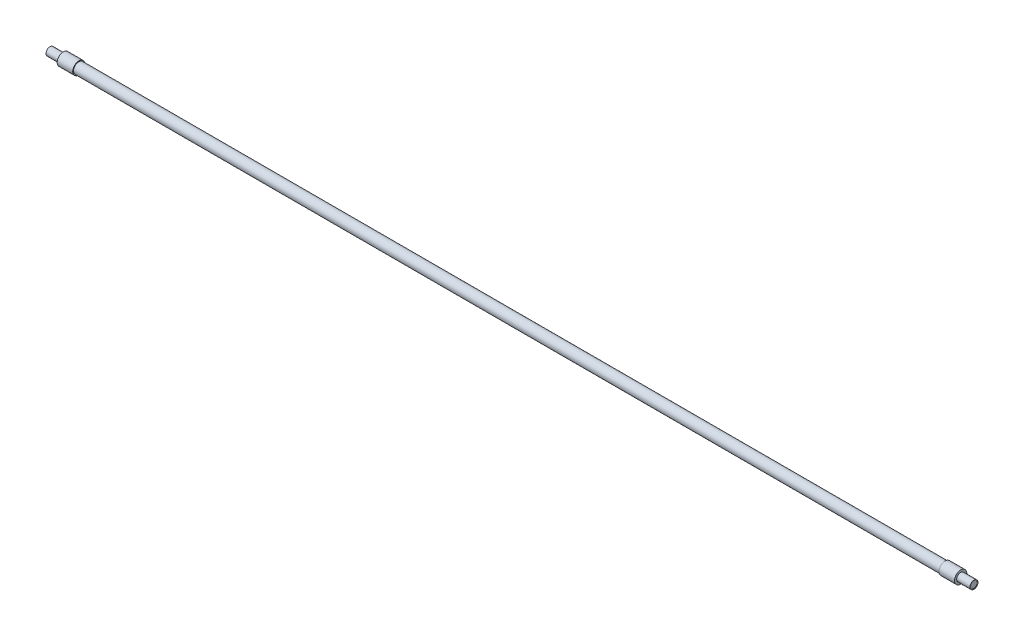
ISO-10303-21;
HEADER;
FILE_DESCRIPTION(('STEP AP214'),'2;1');
FILE_NAME('part.step','',(''),(''),'','','');
FILE_SCHEMA(('AUTOMOTIVE_DESIGN { 1 0 10303 214 1 1 1 1 }'));
ENDSEC;
DATA;
#1=APPLICATION_CONTEXT('core data for automotive mechanical design processes');
#2=APPLICATION_PROTOCOL_DEFINITION('international standard','automotive_design',2000,#1);
#3=PRODUCT_CONTEXT('',#1,'mechanical');
#4=PRODUCT('Part','Part','',(#3));
#5=PRODUCT_RELATED_PRODUCT_CATEGORY('part','',(#4));
#6=PRODUCT_DEFINITION_FORMATION('','',#4);
#7=PRODUCT_DEFINITION_CONTEXT('part definition',#1,'design');
#8=PRODUCT_DEFINITION('design','',#6,#7);
#9=PRODUCT_DEFINITION_SHAPE('','',#8);
#10=(LENGTH_UNIT() NAMED_UNIT(*) SI_UNIT(.MILLI.,.METRE.));
#11=(NAMED_UNIT(*) PLANE_ANGLE_UNIT() SI_UNIT($,.RADIAN.));
#12=(NAMED_UNIT(*) SI_UNIT($,.STERADIAN.) SOLID_ANGLE_UNIT());
#13=UNCERTAINTY_MEASURE_WITH_UNIT(LENGTH_MEASURE(1.E-05),#10,'distance_accuracy_value','');
#14=(GEOMETRIC_REPRESENTATION_CONTEXT(3) GLOBAL_UNCERTAINTY_ASSIGNED_CONTEXT((#13)) GLOBAL_UNIT_ASSIGNED_CONTEXT((#10,
#11,#12)) REPRESENTATION_CONTEXT('',''));
#15=CARTESIAN_POINT('',(0.,0.,0.));
#16=DIRECTION('',(0.,0.,1.));
#17=DIRECTION('',(1.,0.,0.));
#18=AXIS2_PLACEMENT_3D('',#15,#16,#17);
#19=CARTESIAN_POINT('',(28.4,6.05,0.));
#20=DIRECTION('',(-1.,0.,0.));
#21=DIRECTION('',(0.,0.,1.));
#22=AXIS2_PLACEMENT_3D('',#19,#20,#21);
#23=PLANE('',#22);
#24=CARTESIAN_POINT('',(28.4,0.,0.));
#25=DIRECTION('',(-1.,0.,0.));
#26=DIRECTION('',(0.,0.,1.));
#27=AXIS2_PLACEMENT_3D('',#24,#25,#26);
#28=CIRCLE('',#27,6.05);
#29=CARTESIAN_POINT('',(28.4,0.,6.05));
#30=VERTEX_POINT('',#29);
#31=EDGE_CURVE('E58',#30,#30,#28,.T.);
#32=ORIENTED_EDGE('',*,*,#31,.F.);
#33=EDGE_LOOP('',(#32));
#34=FACE_BOUND('',#33,.T.);
#35=CARTESIAN_POINT('',(28.4,0.,0.));
#36=DIRECTION('',(-1.,0.,0.));
#37=DIRECTION('',(0.,0.,1.));
#38=AXIS2_PLACEMENT_3D('',#35,#36,#37);
#39=CIRCLE('',#38,5.25);
#40=CARTESIAN_POINT('',(28.4,0.,5.25));
#41=VERTEX_POINT('',#40);
#42=EDGE_CURVE('E10',#41,#41,#39,.F.);
#43=ORIENTED_EDGE('',*,*,#42,.F.);
#44=EDGE_LOOP('',(#43));
#45=FACE_BOUND('',#44,.T.);
#46=ADVANCED_FACE('F35',(#34,#45),#23,.F.);
#47=CARTESIAN_POINT('',(0.,0.,0.));
#48=DIRECTION('',(1.,0.,0.));
#49=DIRECTION('',(0.,0.,-1.));
#50=AXIS2_PLACEMENT_3D('',#47,#48,#49);
#51=PLANE('',#50);
#52=CARTESIAN_POINT('',(0.,0.,0.));
#53=DIRECTION('',(-1.,0.,0.));
#54=DIRECTION('',(0.,0.,1.));
#55=AXIS2_PLACEMENT_3D('',#52,#53,#54);
#56=CIRCLE('',#55,3.175);
#57=CARTESIAN_POINT('',(0.,0.,3.175));
#58=VERTEX_POINT('',#57);
#59=EDGE_CURVE('E83',#58,#58,#56,.T.);
#60=ORIENTED_EDGE('',*,*,#59,.F.);
#61=EDGE_LOOP('',(#60));
#62=FACE_BOUND('',#61,.T.);
#63=CARTESIAN_POINT('',(0.,0.,0.));
#64=DIRECTION('',(-1.,0.,0.));
#65=DIRECTION('',(0.,0.,1.));
#66=AXIS2_PLACEMENT_3D('',#63,#64,#65);
#67=CIRCLE('',#66,3.95);
#68=CARTESIAN_POINT('',(0.,0.,3.95));
#69=VERTEX_POINT('',#68);
#70=EDGE_CURVE('E50',#69,#69,#67,.T.);
#71=ORIENTED_EDGE('',*,*,#70,.T.);
#72=EDGE_LOOP('',(#71));
#73=FACE_BOUND('',#72,.T.);
#74=ADVANCED_FACE('F98',(#62,#73),#51,.F.);
#75=CARTESIAN_POINT('',(0.,0.,0.));
#76=DIRECTION('',(-1.,0.,0.));
#77=DIRECTION('',(0.,0.,1.));
#78=AXIS2_PLACEMENT_3D('',#75,#76,#77);
#79=CYLINDRICAL_SURFACE('',#78,3.95);
#80=CARTESIAN_POINT('',(12.7,0.,0.));
#81=DIRECTION('',(1.,0.,0.));
#82=DIRECTION('',(0.,0.,-1.));
#83=AXIS2_PLACEMENT_3D('',#80,#81,#82);
#84=CIRCLE('',#83,3.95);
#85=CARTESIAN_POINT('',(12.7,0.,-3.95));
#86=VERTEX_POINT('',#85);
#87=EDGE_CURVE('E46',#86,#86,#84,.F.);
#88=ORIENTED_EDGE('',*,*,#87,.T.);
#89=EDGE_LOOP('',(#88));
#90=FACE_BOUND('',#89,.T.);
#91=ORIENTED_EDGE('',*,*,#70,.F.);
#92=EDGE_LOOP('',(#91));
#93=FACE_BOUND('',#92,.T.);
#94=ADVANCED_FACE('F101',(#90,#93),#79,.T.);
#95=CARTESIAN_POINT('',(13.1,3.95,0.));
#96=DIRECTION('',(1.,0.,0.));
#97=DIRECTION('',(0.,0.,-1.));
#98=AXIS2_PLACEMENT_3D('',#95,#96,#97);
#99=PLANE('',#98);
#100=CARTESIAN_POINT('',(13.1,0.,0.));
#101=DIRECTION('',(1.,0.,0.));
#102=DIRECTION('',(0.,0.,-1.));
#103=AXIS2_PLACEMENT_3D('',#100,#101,#102);
#104=CIRCLE('',#103,4.35);
#105=CARTESIAN_POINT('',(13.1,0.,-4.35));
#106=VERTEX_POINT('',#105);
#107=EDGE_CURVE('E42',#106,#106,#104,.T.);
#108=ORIENTED_EDGE('',*,*,#107,.T.);
#109=EDGE_LOOP('',(#108));
#110=FACE_BOUND('',#109,.T.);
#111=CARTESIAN_POINT('',(13.1,0.,0.));
#112=DIRECTION('',(-1.,0.,0.));
#113=DIRECTION('',(0.,0.,1.));
#114=AXIS2_PLACEMENT_3D('',#111,#112,#113);
#115=CIRCLE('',#114,6.05);
#116=CARTESIAN_POINT('',(13.1,0.,6.05));
#117=VERTEX_POINT('',#116);
#118=EDGE_CURVE('E55',#117,#117,#115,.T.);
#119=ORIENTED_EDGE('',*,*,#118,.T.);
#120=EDGE_LOOP('',(#119));
#121=FACE_BOUND('',#120,.T.);
#122=ADVANCED_FACE('F105',(#110,#121),#99,.F.);
#123=CARTESIAN_POINT('',(0.,0.,0.));
#124=DIRECTION('',(-1.,0.,0.));
#125=DIRECTION('',(0.,0.,1.));
#126=AXIS2_PLACEMENT_3D('',#123,#124,#125);
#127=CYLINDRICAL_SURFACE('',#126,6.05);
#128=ORIENTED_EDGE('',*,*,#118,.F.);
#129=EDGE_LOOP('',(#128));
#130=FACE_BOUND('',#129,.T.);
#131=ORIENTED_EDGE('',*,*,#31,.T.);
#132=EDGE_LOOP('',(#131));
#133=FACE_BOUND('',#132,.T.);
#134=ADVANCED_FACE('F111',(#130,#133),#127,.T.);
#135=CARTESIAN_POINT('',(12.7,0.,0.));
#136=DIRECTION('',(1.,0.,0.));
#137=DIRECTION('',(0.,0.,-1.));
#138=AXIS2_PLACEMENT_3D('',#135,#136,#137);
#139=TOROIDAL_SURFACE('',#138,4.35,0.4);
#140=ORIENTED_EDGE('',*,*,#107,.F.);
#141=EDGE_LOOP('',(#140));
#142=FACE_BOUND('',#141,.T.);
#143=ORIENTED_EDGE('',*,*,#87,.F.);
#144=EDGE_LOOP('',(#143));
#145=FACE_BOUND('',#144,.T.);
#146=ADVANCED_FACE('F37',(#142,#145),#139,.F.);
#147=CARTESIAN_POINT('',(881.6,0.,0.));
#148=DIRECTION('',(-1.,0.,0.));
#149=DIRECTION('',(0.,0.,1.));
#150=AXIS2_PLACEMENT_3D('',#147,#148,#149);
#151=CYLINDRICAL_SURFACE('',#150,5.25);
#152=CARTESIAN_POINT('',(881.6,0.,0.));
#153=DIRECTION('',(1.,0.,0.));
#154=DIRECTION('',(0.,0.,-1.));
#155=AXIS2_PLACEMENT_3D('',#152,#153,#154);
#156=CIRCLE('',#155,5.25);
#157=CARTESIAN_POINT('',(881.6,0.,-5.25));
#158=VERTEX_POINT('',#157);
#159=EDGE_CURVE('E61',#158,#158,#156,.T.);
#160=ORIENTED_EDGE('',*,*,#159,.F.);
#161=EDGE_LOOP('',(#160));
#162=FACE_BOUND('',#161,.T.);
#163=ORIENTED_EDGE('',*,*,#42,.T.);
#164=EDGE_LOOP('',(#163));
#165=FACE_BOUND('',#164,.T.);
#166=ADVANCED_FACE('F122',(#162,#165),#151,.T.);
#167=CARTESIAN_POINT('',(881.6,6.05,0.));
#168=DIRECTION('',(1.,0.,0.));
#169=DIRECTION('',(0.,0.,1.));
#170=AXIS2_PLACEMENT_3D('',#167,#168,#169);
#171=PLANE('',#170);
#172=CARTESIAN_POINT('',(881.6,0.,0.));
#173=DIRECTION('',(-1.,0.,0.));
#174=DIRECTION('',(0.,0.,1.));
#175=AXIS2_PLACEMENT_3D('',#172,#173,#174);
#176=CIRCLE('',#175,6.05);
#177=CARTESIAN_POINT('',(881.6,0.,6.05));
#178=VERTEX_POINT('',#177);
#179=EDGE_CURVE('E73',#178,#178,#176,.T.);
#180=ORIENTED_EDGE('',*,*,#179,.T.);
#181=EDGE_LOOP('',(#180));
#182=FACE_BOUND('',#181,.T.);
#183=ORIENTED_EDGE('',*,*,#159,.T.);
#184=EDGE_LOOP('',(#183));
#185=FACE_BOUND('',#184,.T.);
#186=ADVANCED_FACE('F136',(#182,#185),#171,.F.);
#187=CARTESIAN_POINT('',(910.,0.,0.));
#188=DIRECTION('',(-1.,0.,0.));
#189=DIRECTION('',(0.,0.,-1.));
#190=AXIS2_PLACEMENT_3D('',#187,#188,#189);
#191=PLANE('',#190);
#192=CARTESIAN_POINT('',(910.,0.,0.));
#193=DIRECTION('',(1.,0.,0.));
#194=DIRECTION('',(0.,0.,-1.));
#195=AXIS2_PLACEMENT_3D('',#192,#193,#194);
#196=CIRCLE('',#195,3.175);
#197=CARTESIAN_POINT('',(910.,0.,-3.175));
#198=VERTEX_POINT('',#197);
#199=EDGE_CURVE('E77',#198,#198,#196,.T.);
#200=ORIENTED_EDGE('',*,*,#199,.F.);
#201=EDGE_LOOP('',(#200));
#202=FACE_BOUND('',#201,.T.);
#203=CARTESIAN_POINT('',(910.,0.,0.));
#204=DIRECTION('',(-1.,0.,0.));
#205=DIRECTION('',(0.,0.,1.));
#206=AXIS2_PLACEMENT_3D('',#203,#204,#205);
#207=CIRCLE('',#206,3.95);
#208=CARTESIAN_POINT('',(910.,0.,3.95));
#209=VERTEX_POINT('',#208);
#210=EDGE_CURVE('E64',#209,#209,#207,.T.);
#211=ORIENTED_EDGE('',*,*,#210,.F.);
#212=EDGE_LOOP('',(#211));
#213=FACE_BOUND('',#212,.T.);
#214=ADVANCED_FACE('F143',(#202,#213),#191,.F.);
#215=CARTESIAN_POINT('',(910.,0.,0.));
#216=DIRECTION('',(1.,0.,0.));
#217=DIRECTION('',(0.,0.,1.));
#218=AXIS2_PLACEMENT_3D('',#215,#216,#217);
#219=CYLINDRICAL_SURFACE('',#218,3.95);
#220=ORIENTED_EDGE('',*,*,#210,.T.);
#221=EDGE_LOOP('',(#220));
#222=FACE_BOUND('',#221,.T.);
#223=CARTESIAN_POINT('',(896.9,0.,0.));
#224=DIRECTION('',(-1.,0.,0.));
#225=DIRECTION('',(0.,0.,1.));
#226=AXIS2_PLACEMENT_3D('',#223,#224,#225);
#227=CIRCLE('',#226,3.95);
#228=CARTESIAN_POINT('',(896.9,0.,3.95));
#229=VERTEX_POINT('',#228);
#230=EDGE_CURVE('E67',#229,#229,#227,.T.);
#231=ORIENTED_EDGE('',*,*,#230,.F.);
#232=EDGE_LOOP('',(#231));
#233=FACE_BOUND('',#232,.T.);
#234=ADVANCED_FACE('F151',(#222,#233),#219,.T.);
#235=CARTESIAN_POINT('',(896.9,3.95,0.));
#236=DIRECTION('',(-1.,0.,0.));
#237=DIRECTION('',(0.,0.,-1.));
#238=AXIS2_PLACEMENT_3D('',#235,#236,#237);
#239=PLANE('',#238);
#240=ORIENTED_EDGE('',*,*,#230,.T.);
#241=EDGE_LOOP('',(#240));
#242=FACE_BOUND('',#241,.T.);
#243=CARTESIAN_POINT('',(896.9,0.,0.));
#244=DIRECTION('',(-1.,0.,0.));
#245=DIRECTION('',(0.,0.,1.));
#246=AXIS2_PLACEMENT_3D('',#243,#244,#245);
#247=CIRCLE('',#246,6.05);
#248=CARTESIAN_POINT('',(896.9,0.,6.05));
#249=VERTEX_POINT('',#248);
#250=EDGE_CURVE('E70',#249,#249,#247,.T.);
#251=ORIENTED_EDGE('',*,*,#250,.F.);
#252=EDGE_LOOP('',(#251));
#253=FACE_BOUND('',#252,.T.);
#254=ADVANCED_FACE('F160',(#242,#253),#239,.F.);
#255=CARTESIAN_POINT('',(910.,0.,0.));
#256=DIRECTION('',(1.,0.,0.));
#257=DIRECTION('',(0.,0.,1.));
#258=AXIS2_PLACEMENT_3D('',#255,#256,#257);
#259=CYLINDRICAL_SURFACE('',#258,6.05);
#260=ORIENTED_EDGE('',*,*,#250,.T.);
#261=EDGE_LOOP('',(#260));
#262=FACE_BOUND('',#261,.T.);
#263=ORIENTED_EDGE('',*,*,#179,.F.);
#264=EDGE_LOOP('',(#263));
#265=FACE_BOUND('',#264,.T.);
#266=ADVANCED_FACE('F157',(#262,#265),#259,.T.);
#267=CARTESIAN_POINT('',(909.8,0.,0.));
#268=DIRECTION('',(1.,0.,0.));
#269=DIRECTION('',(0.,0.,-1.));
#270=AXIS2_PLACEMENT_3D('',#267,#268,#269);
#271=CYLINDRICAL_SURFACE('',#270,3.175);
#272=CARTESIAN_POINT('',(909.8,0.,0.));
#273=DIRECTION('',(1.,0.,0.));
#274=DIRECTION('',(0.,0.,-1.));
#275=AXIS2_PLACEMENT_3D('',#272,#273,#274);
#276=CIRCLE('',#275,3.175);
#277=CARTESIAN_POINT('',(909.8,0.,-3.175));
#278=VERTEX_POINT('',#277);
#279=EDGE_CURVE('E76',#278,#278,#276,.T.);
#280=ORIENTED_EDGE('',*,*,#279,.F.);
#281=EDGE_LOOP('',(#280));
#282=FACE_BOUND('',#281,.T.);
#283=ORIENTED_EDGE('',*,*,#199,.T.);
#284=EDGE_LOOP('',(#283));
#285=FACE_BOUND('',#284,.T.);
#286=ADVANCED_FACE('F155',(#282,#285),#271,.F.);
#287=CARTESIAN_POINT('',(909.8,0.,0.));
#288=DIRECTION('',(1.,0.,0.));
#289=DIRECTION('',(0.,0.,-1.));
#290=AXIS2_PLACEMENT_3D('',#287,#288,#289);
#291=PLANE('',#290);
#292=ORIENTED_EDGE('',*,*,#279,.T.);
#293=EDGE_LOOP('',(#292));
#294=FACE_BOUND('',#293,.T.);
#295=ADVANCED_FACE('F94',(#294),#291,.T.);
#296=CARTESIAN_POINT('',(0.2,0.,0.));
#297=DIRECTION('',(-1.,0.,0.));
#298=DIRECTION('',(0.,0.,1.));
#299=AXIS2_PLACEMENT_3D('',#296,#297,#298);
#300=CYLINDRICAL_SURFACE('',#299,3.175);
#301=CARTESIAN_POINT('',(0.2,0.,0.));
#302=DIRECTION('',(-1.,0.,0.));
#303=DIRECTION('',(0.,0.,1.));
#304=AXIS2_PLACEMENT_3D('',#301,#302,#303);
#305=CIRCLE('',#304,3.175);
#306=CARTESIAN_POINT('',(0.2,0.,3.175));
#307=VERTEX_POINT('',#306);
#308=EDGE_CURVE('E80',#307,#307,#305,.T.);
#309=ORIENTED_EDGE('',*,*,#308,.F.);
#310=EDGE_LOOP('',(#309));
#311=FACE_BOUND('',#310,.T.);
#312=ORIENTED_EDGE('',*,*,#59,.T.);
#313=EDGE_LOOP('',(#312));
#314=FACE_BOUND('',#313,.T.);
#315=ADVANCED_FACE('F91',(#311,#314),#300,.F.);
#316=CARTESIAN_POINT('',(0.2,0.,0.));
#317=DIRECTION('',(-1.,0.,0.));
#318=DIRECTION('',(0.,0.,1.));
#319=AXIS2_PLACEMENT_3D('',#316,#317,#318);
#320=PLANE('',#319);
#321=ORIENTED_EDGE('',*,*,#308,.T.);
#322=EDGE_LOOP('',(#321));
#323=FACE_BOUND('',#322,.T.);
#324=ADVANCED_FACE('F89',(#323),#320,.T.);
#325=CLOSED_SHELL('',(#46,#74,#94,#122,#134,#146,#166,#186,#214,#234,#254,#266,#286,#295,#315,#324));
#326=MANIFOLD_SOLID_BREP('B2',#325);
#327=ADVANCED_BREP_SHAPE_REPRESENTATION('',(#18,#326),#14);
#328=SHAPE_DEFINITION_REPRESENTATION(#9,#327);
ENDSEC;
END-ISO-10303-21;
